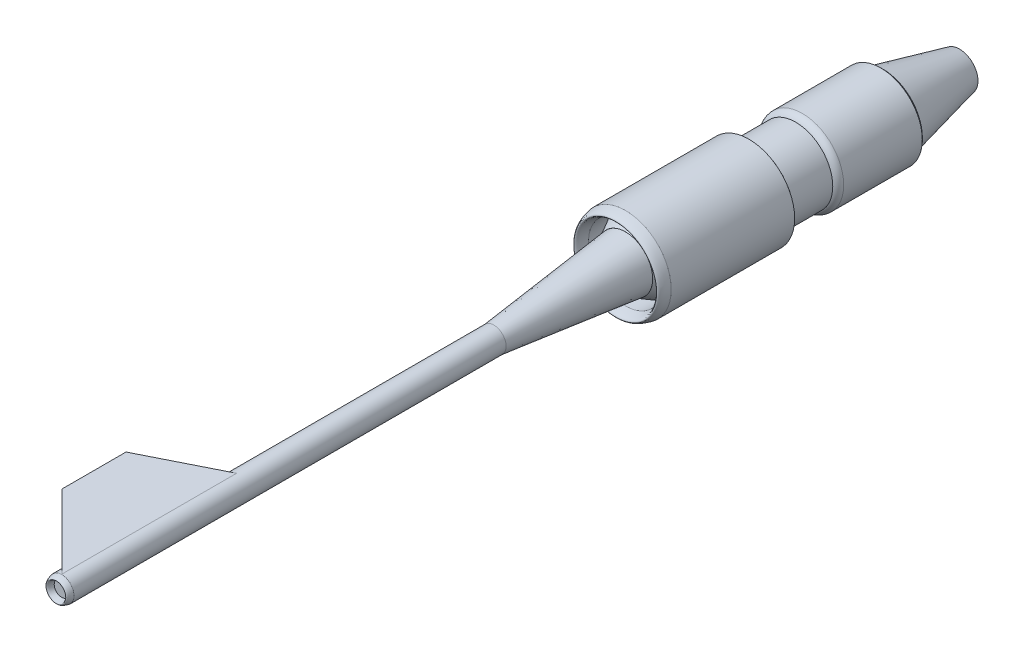
ISO-10303-21;
HEADER;
FILE_DESCRIPTION(('STEP AP214'),'2;1');
FILE_NAME('part.step','',(''),(''),'','','');
FILE_SCHEMA(('AUTOMOTIVE_DESIGN { 1 0 10303 214 1 1 1 1 }'));
ENDSEC;
DATA;
#1=APPLICATION_CONTEXT('core data for automotive mechanical design processes');
#2=APPLICATION_PROTOCOL_DEFINITION('international standard','automotive_design',2000,#1);
#3=PRODUCT_CONTEXT('',#1,'mechanical');
#4=PRODUCT('Part','Part','',(#3));
#5=PRODUCT_RELATED_PRODUCT_CATEGORY('part','',(#4));
#6=PRODUCT_DEFINITION_FORMATION('','',#4);
#7=PRODUCT_DEFINITION_CONTEXT('part definition',#1,'design');
#8=PRODUCT_DEFINITION('design','',#6,#7);
#9=PRODUCT_DEFINITION_SHAPE('','',#8);
#10=(LENGTH_UNIT() NAMED_UNIT(*) SI_UNIT(.MILLI.,.METRE.));
#11=(NAMED_UNIT(*) PLANE_ANGLE_UNIT() SI_UNIT($,.RADIAN.));
#12=(NAMED_UNIT(*) SI_UNIT($,.STERADIAN.) SOLID_ANGLE_UNIT());
#13=UNCERTAINTY_MEASURE_WITH_UNIT(LENGTH_MEASURE(1.E-05),#10,'distance_accuracy_value','');
#14=(GEOMETRIC_REPRESENTATION_CONTEXT(3) GLOBAL_UNCERTAINTY_ASSIGNED_CONTEXT((#13)) GLOBAL_UNIT_ASSIGNED_CONTEXT((#10,
#11,#12)) REPRESENTATION_CONTEXT('',''));
#15=CARTESIAN_POINT('',(0.,0.,0.));
#16=DIRECTION('',(0.,0.,1.));
#17=DIRECTION('',(1.,0.,0.));
#18=AXIS2_PLACEMENT_3D('',#15,#16,#17);
#19=CARTESIAN_POINT('',(1.46957615897682E-13,0.,5137.5));
#20=DIRECTION('',(0.,0.,-1.));
#21=DIRECTION('',(-1.,0.,0.));
#22=AXIS2_PLACEMENT_3D('',#19,#20,#21);
#23=CYLINDRICAL_SURFACE('',#22,112.5);
#24=CARTESIAN_POINT('',(1.46957615897682E-13,0.,3540.88446251693));
#25=DIRECTION('',(-0.447213595499958,0.,-0.894427190999916));
#26=DIRECTION('',(0.894427190999916,0.,-0.447213595499958));
#27=AXIS2_PLACEMENT_3D('',#24,#25,#26);
#28=ELLIPSE('',#27,125.778823734363,112.5);
#29=CARTESIAN_POINT('',(-93.5507258153162,62.4860920479709,3587.65982542459));
#30=VERTEX_POINT('',#29);
#31=CARTESIAN_POINT('',(-1.76892503385784,112.486092047971,3541.76892503386));
#32=VERTEX_POINT('',#31);
#33=EDGE_CURVE('E12',#30,#32,#28,.T.);
#34=ORIENTED_EDGE('',*,*,#33,.T.);
#35=DIRECTION('',(0.,0.,-1.));
#36=VECTOR('',#35,1.);
#37=CARTESIAN_POINT('',(-1.76892503385783,112.486092047971,5137.5));
#38=LINE('',#37,#36);
#39=CARTESIAN_POINT('',(-1.76892503385784,112.486092047971,5133.96214993228));
#40=VERTEX_POINT('',#39);
#41=EDGE_CURVE('E73',#32,#40,#38,.F.);
#42=ORIENTED_EDGE('',*,*,#41,.T.);
#43=CARTESIAN_POINT('',(1.46957615897682E-13,0.,5135.73107496614));
#44=DIRECTION('',(-0.707106781186547,0.,0.707106781186548));
#45=DIRECTION('',(-0.707106781186548,0.,-0.707106781186547));
#46=AXIS2_PLACEMENT_3D('',#43,#44,#45);
#47=ELLIPSE('',#46,159.099025766973,112.5);
#48=CARTESIAN_POINT('',(-93.5507258153162,62.4860920479709,5042.18034915083));
#49=VERTEX_POINT('',#48);
#50=EDGE_CURVE('E123',#40,#49,#47,.T.);
#51=ORIENTED_EDGE('',*,*,#50,.T.);
#52=DIRECTION('',(0.,0.,-1.));
#53=VECTOR('',#52,1.);
#54=CARTESIAN_POINT('',(-93.5507258153162,62.4860920479709,5137.5));
#55=LINE('',#54,#53);
#56=EDGE_CURVE('E120',#30,#49,#55,.F.);
#57=ORIENTED_EDGE('',*,*,#56,.F.);
#58=EDGE_LOOP('',(#34,#42,#51,#57));
#59=FACE_BOUND('',#58,.T.);
#60=CARTESIAN_POINT('',(1.46957615897682E-13,0.,1200.));
#61=DIRECTION('',(0.,0.,1.));
#62=DIRECTION('',(1.,0.,0.));
#63=AXIS2_PLACEMENT_3D('',#60,#61,#62);
#64=CIRCLE('',#63,112.5);
#65=CARTESIAN_POINT('',(112.5,0.,1200.));
#66=VERTEX_POINT('',#65);
#67=EDGE_CURVE('E169',#66,#66,#64,.T.);
#68=ORIENTED_EDGE('',*,*,#67,.T.);
#69=EDGE_LOOP('',(#68));
#70=FACE_BOUND('',#69,.T.);
#71=CARTESIAN_POINT('',(1.46957615897682E-13,0.,5137.5));
#72=DIRECTION('',(0.,0.,1.));
#73=DIRECTION('',(1.,0.,0.));
#74=AXIS2_PLACEMENT_3D('',#71,#72,#73);
#75=CIRCLE('',#74,112.5);
#76=CARTESIAN_POINT('',(112.5,0.,5137.5));
#77=VERTEX_POINT('',#76);
#78=EDGE_CURVE('E171',#77,#77,#75,.T.);
#79=ORIENTED_EDGE('',*,*,#78,.F.);
#80=EDGE_LOOP('',(#79));
#81=FACE_BOUND('',#80,.T.);
#82=ADVANCED_FACE('F52',(#59,#70,#81),#23,.T.);
#83=CARTESIAN_POINT('',(0.,0.,0.));
#84=DIRECTION('',(0.,0.,1.));
#85=DIRECTION('',(1.,0.,0.));
#86=AXIS2_PLACEMENT_3D('',#83,#84,#85);
#87=PLANE('',#86);
#88=CARTESIAN_POINT('',(0.,0.,0.));
#89=DIRECTION('',(0.,0.,-1.));
#90=DIRECTION('',(-1.,0.,0.));
#91=AXIS2_PLACEMENT_3D('',#88,#89,#90);
#92=CIRCLE('',#91,247.5);
#93=CARTESIAN_POINT('',(-247.5,0.,0.));
#94=VERTEX_POINT('',#93);
#95=EDGE_CURVE('E61',#94,#94,#92,.T.);
#96=ORIENTED_EDGE('',*,*,#95,.T.);
#97=EDGE_LOOP('',(#96));
#98=FACE_BOUND('',#97,.T.);
#99=ADVANCED_FACE('F54',(#98),#87,.F.);
#100=CARTESIAN_POINT('',(1.46957615897682E-13,0.,1200.));
#101=DIRECTION('',(0.,0.,-1.));
#102=DIRECTION('',(-1.,0.,0.));
#103=AXIS2_PLACEMENT_3D('',#100,#101,#102);
#104=CONICAL_SURFACE('',#103,112.5,0.112028962425988);
#105=ORIENTED_EDGE('',*,*,#95,.F.);
#106=EDGE_LOOP('',(#105));
#107=FACE_BOUND('',#106,.T.);
#108=ORIENTED_EDGE('',*,*,#67,.F.);
#109=EDGE_LOOP('',(#108));
#110=FACE_BOUND('',#109,.T.);
#111=ADVANCED_FACE('F148',(#107,#110),#104,.T.);
#112=CARTESIAN_POINT('',(0.,67.5,5137.5));
#113=CARTESIAN_POINT('',(0.,90.,5237.5));
#114=CARTESIAN_POINT('',(0.,112.5,5137.5));
#115=B_SPLINE_CURVE_WITH_KNOTS('',2,(#112,#113,#114),.UNSPECIFIED.,.F.,.F.,(3,3),(0.,1.),.UNSPECIFIED.);
#116=CARTESIAN_POINT('',(0.,0.,5137.5));
#117=DIRECTION('',(0.,0.,-1.));
#118=AXIS1_PLACEMENT('',#116,#117);
#119=SURFACE_OF_REVOLUTION('',#115,#118);
#120=ORIENTED_EDGE('',*,*,#78,.T.);
#121=EDGE_LOOP('',(#120));
#122=FACE_BOUND('',#121,.T.);
#123=CARTESIAN_POINT('',(0.,0.,5137.5));
#124=DIRECTION('',(0.,0.,-1.));
#125=DIRECTION('',(0.,1.,0.));
#126=AXIS2_PLACEMENT_3D('',#123,#124,#125);
#127=CIRCLE('',#126,67.5);
#128=CARTESIAN_POINT('',(0.,67.5,5137.5));
#129=VERTEX_POINT('',#128);
#130=EDGE_CURVE('E130',#129,#129,#127,.T.);
#131=ORIENTED_EDGE('',*,*,#130,.T.);
#132=EDGE_LOOP('',(#131));
#133=FACE_BOUND('',#132,.T.);
#134=ADVANCED_FACE('F143',(#122,#133),#119,.T.);
#135=CARTESIAN_POINT('',(1.46957615897682E-13,0.,5137.5));
#136=DIRECTION('',(0.,0.,1.));
#137=DIRECTION('',(1.,0.,0.));
#138=AXIS2_PLACEMENT_3D('',#135,#136,#137);
#139=PLANE('',#138);
#140=ORIENTED_EDGE('',*,*,#130,.F.);
#141=EDGE_LOOP('',(#140));
#142=FACE_BOUND('',#141,.T.);
#143=ADVANCED_FACE('F147',(#142),#139,.T.);
#144=CARTESIAN_POINT('',(0.,112.486092047971,0.));
#145=DIRECTION('',(0.,1.,0.));
#146=DIRECTION('',(0.,0.,1.));
#147=AXIS2_PLACEMENT_3D('',#144,#145,#146);
#148=PLANE('',#147);
#149=ORIENTED_EDGE('',*,*,#41,.F.);
#150=DIRECTION('',(-0.894427190999916,0.,0.447213595499958));
#151=VECTOR('',#150,1.);
#152=CARTESIAN_POINT('',(-673.231074966143,112.486092047971,3877.5));
#153=LINE('',#152,#151);
#154=CARTESIAN_POINT('',(-673.231074966143,112.486092047971,3877.5));
#155=VERTEX_POINT('',#154);
#156=EDGE_CURVE('E118',#32,#155,#153,.T.);
#157=ORIENTED_EDGE('',*,*,#156,.T.);
#158=DIRECTION('',(0.,0.,1.));
#159=VECTOR('',#158,1.);
#160=CARTESIAN_POINT('',(-673.231074966143,112.486092047971,4462.5));
#161=LINE('',#160,#159);
#162=CARTESIAN_POINT('',(-673.231074966143,112.486092047971,4462.5));
#163=VERTEX_POINT('',#162);
#164=EDGE_CURVE('E108',#155,#163,#161,.T.);
#165=ORIENTED_EDGE('',*,*,#164,.T.);
#166=DIRECTION('',(0.707106781186548,0.,0.707106781186547));
#167=VECTOR('',#166,1.);
#168=CARTESIAN_POINT('',(-673.231074966143,112.486092047971,4462.5));
#169=LINE('',#168,#167);
#170=EDGE_CURVE('E68',#163,#40,#169,.T.);
#171=ORIENTED_EDGE('',*,*,#170,.T.);
#172=EDGE_LOOP('',(#149,#157,#165,#171));
#173=FACE_BOUND('',#172,.T.);
#174=ADVANCED_FACE('F154',(#173),#148,.T.);
#175=CARTESIAN_POINT('',(-673.231074966143,62.4860920479709,4462.5));
#176=DIRECTION('',(-0.707106781186547,0.,0.707106781186548));
#177=DIRECTION('',(0.707106781186548,0.,0.707106781186547));
#178=AXIS2_PLACEMENT_3D('',#175,#176,#177);
#179=PLANE('',#178);
#180=ORIENTED_EDGE('',*,*,#50,.F.);
#181=ORIENTED_EDGE('',*,*,#170,.F.);
#182=DIRECTION('',(0.,1.,0.));
#183=VECTOR('',#182,1.);
#184=CARTESIAN_POINT('',(-673.231074966143,62.4860920479709,4462.5));
#185=LINE('',#184,#183);
#186=CARTESIAN_POINT('',(-673.231074966143,62.4860920479709,4462.5));
#187=VERTEX_POINT('',#186);
#188=EDGE_CURVE('E109',#187,#163,#185,.T.);
#189=ORIENTED_EDGE('',*,*,#188,.F.);
#190=DIRECTION('',(0.707106781186548,0.,0.707106781186547));
#191=VECTOR('',#190,1.);
#192=CARTESIAN_POINT('',(-673.231074966143,62.4860920479709,4462.5));
#193=LINE('',#192,#191);
#194=EDGE_CURVE('E103',#187,#49,#193,.T.);
#195=ORIENTED_EDGE('',*,*,#194,.T.);
#196=EDGE_LOOP('',(#180,#181,#189,#195));
#197=FACE_BOUND('',#196,.T.);
#198=ADVANCED_FACE('F150',(#197),#179,.T.);
#199=CARTESIAN_POINT('',(0.,62.4860920479709,0.));
#200=DIRECTION('',(0.,1.,0.));
#201=DIRECTION('',(0.,0.,1.));
#202=AXIS2_PLACEMENT_3D('',#199,#200,#201);
#203=PLANE('',#202);
#204=DIRECTION('',(-0.894427190999916,0.,0.447213595499958));
#205=VECTOR('',#204,1.);
#206=CARTESIAN_POINT('',(-673.231074966143,62.4860920479709,3877.5));
#207=LINE('',#206,#205);
#208=CARTESIAN_POINT('',(-673.231074966143,62.4860920479709,3877.5));
#209=VERTEX_POINT('',#208);
#210=EDGE_CURVE('E94',#30,#209,#207,.T.);
#211=ORIENTED_EDGE('',*,*,#210,.F.);
#212=ORIENTED_EDGE('',*,*,#56,.T.);
#213=ORIENTED_EDGE('',*,*,#194,.F.);
#214=DIRECTION('',(0.,0.,1.));
#215=VECTOR('',#214,1.);
#216=CARTESIAN_POINT('',(-673.231074966143,62.4860920479709,4462.5));
#217=LINE('',#216,#215);
#218=EDGE_CURVE('E102',#209,#187,#217,.T.);
#219=ORIENTED_EDGE('',*,*,#218,.F.);
#220=EDGE_LOOP('',(#211,#212,#213,#219));
#221=FACE_BOUND('',#220,.T.);
#222=ADVANCED_FACE('F112',(#221),#203,.F.);
#223=CARTESIAN_POINT('',(-673.231074966143,62.4860920479709,4462.5));
#224=DIRECTION('',(-1.,0.,0.));
#225=DIRECTION('',(0.,0.,1.));
#226=AXIS2_PLACEMENT_3D('',#223,#224,#225);
#227=PLANE('',#226);
#228=ORIENTED_EDGE('',*,*,#164,.F.);
#229=DIRECTION('',(0.,1.,0.));
#230=VECTOR('',#229,1.);
#231=CARTESIAN_POINT('',(-673.231074966143,62.4860920479709,3877.5));
#232=LINE('',#231,#230);
#233=EDGE_CURVE('E97',#209,#155,#232,.T.);
#234=ORIENTED_EDGE('',*,*,#233,.F.);
#235=ORIENTED_EDGE('',*,*,#218,.T.);
#236=ORIENTED_EDGE('',*,*,#188,.T.);
#237=EDGE_LOOP('',(#228,#234,#235,#236));
#238=FACE_BOUND('',#237,.T.);
#239=ADVANCED_FACE('F107',(#238),#227,.T.);
#240=CARTESIAN_POINT('',(-673.231074966143,62.4860920479709,3877.5));
#241=DIRECTION('',(-0.447213595499958,0.,-0.894427190999916));
#242=DIRECTION('',(-0.894427190999916,0.,0.447213595499958));
#243=AXIS2_PLACEMENT_3D('',#240,#241,#242);
#244=PLANE('',#243);
#245=ORIENTED_EDGE('',*,*,#33,.F.);
#246=ORIENTED_EDGE('',*,*,#210,.T.);
#247=ORIENTED_EDGE('',*,*,#233,.T.);
#248=ORIENTED_EDGE('',*,*,#156,.F.);
#249=EDGE_LOOP('',(#245,#246,#247,#248));
#250=FACE_BOUND('',#249,.T.);
#251=ADVANCED_FACE('F96',(#250),#244,.T.);
#252=CLOSED_SHELL('',(#82,#99,#111,#134,#143,#174,#198,#222,#239,#251));
#253=MANIFOLD_SOLID_BREP('B2',#252);
#254=CARTESIAN_POINT('',(0.,0.,-1125.));
#255=DIRECTION('',(0.,0.,1.));
#256=DIRECTION('',(1.,0.,0.));
#257=AXIS2_PLACEMENT_3D('',#254,#255,#256);
#258=CYLINDRICAL_SURFACE('',#257,337.5);
#259=CARTESIAN_POINT('',(0.,0.,-306.632414300902));
#260=DIRECTION('',(0.,0.,1.));
#261=DIRECTION('',(1.,0.,0.));
#262=AXIS2_PLACEMENT_3D('',#259,#260,#261);
#263=CIRCLE('',#262,337.5);
#264=CARTESIAN_POINT('',(337.5,0.,-306.632414300902));
#265=VERTEX_POINT('',#264);
#266=EDGE_CURVE('E265',#265,#265,#263,.F.);
#267=ORIENTED_EDGE('',*,*,#266,.F.);
#268=EDGE_LOOP('',(#267));
#269=FACE_BOUND('',#268,.T.);
#270=CARTESIAN_POINT('',(0.,0.,-1125.));
#271=DIRECTION('',(0.,0.,-1.));
#272=DIRECTION('',(-1.,0.,0.));
#273=AXIS2_PLACEMENT_3D('',#270,#271,#272);
#274=CIRCLE('',#273,337.5);
#275=CARTESIAN_POINT('',(-337.5,0.,-1125.));
#276=VERTEX_POINT('',#275);
#277=EDGE_CURVE('E261',#276,#276,#274,.F.);
#278=ORIENTED_EDGE('',*,*,#277,.F.);
#279=EDGE_LOOP('',(#278));
#280=FACE_BOUND('',#279,.T.);
#281=ADVANCED_FACE('F254',(#269,#280),#258,.F.);
#282=CARTESIAN_POINT('',(0.,0.,0.));
#283=DIRECTION('',(0.,0.,1.));
#284=DIRECTION('',(1.,0.,0.));
#285=AXIS2_PLACEMENT_3D('',#282,#283,#284);
#286=CIRCLE('',#285,337.5);
#287=CARTESIAN_POINT('',(337.5,0.,0.));
#288=VERTEX_POINT('',#287);
#289=EDGE_CURVE('E277',#288,#288,#286,.T.);
#290=ORIENTED_EDGE('',*,*,#289,.T.);
#291=EDGE_LOOP('',(#290));
#292=FACE_BOUND('',#291,.T.);
#293=CARTESIAN_POINT('',(0.,0.,-163.537287627148));
#294=DIRECTION('',(0.,0.,-1.));
#295=DIRECTION('',(-1.,0.,0.));
#296=AXIS2_PLACEMENT_3D('',#293,#294,#295);
#297=CIRCLE('',#296,337.5);
#298=CARTESIAN_POINT('',(-337.5,0.,-163.537287627148));
#299=VERTEX_POINT('',#298);
#300=EDGE_CURVE('E269',#299,#299,#297,.F.);
#301=ORIENTED_EDGE('',*,*,#300,.F.);
#302=EDGE_LOOP('',(#301));
#303=FACE_BOUND('',#302,.T.);
#304=ADVANCED_FACE('F298',(#292,#303),#258,.F.);
#305=CARTESIAN_POINT('',(0.,0.,-1125.));
#306=DIRECTION('',(0.,0.,1.));
#307=DIRECTION('',(1.,0.,0.));
#308=AXIS2_PLACEMENT_3D('',#305,#306,#307);
#309=CYLINDRICAL_SURFACE('',#308,416.25);
#310=CARTESIAN_POINT('',(0.,0.,-1125.));
#311=DIRECTION('',(0.,0.,1.));
#312=DIRECTION('',(1.,0.,0.));
#313=AXIS2_PLACEMENT_3D('',#310,#311,#312);
#314=CIRCLE('',#313,416.25);
#315=CARTESIAN_POINT('',(416.25,0.,-1125.));
#316=VERTEX_POINT('',#315);
#317=EDGE_CURVE('E332',#316,#316,#314,.T.);
#318=ORIENTED_EDGE('',*,*,#317,.T.);
#319=EDGE_LOOP('',(#318));
#320=FACE_BOUND('',#319,.T.);
#321=CARTESIAN_POINT('',(0.,0.,0.));
#322=DIRECTION('',(0.,0.,1.));
#323=DIRECTION('',(1.,0.,0.));
#324=AXIS2_PLACEMENT_3D('',#321,#322,#323);
#325=CIRCLE('',#324,416.25);
#326=CARTESIAN_POINT('',(416.25,0.,0.));
#327=VERTEX_POINT('',#326);
#328=EDGE_CURVE('E274',#327,#327,#325,.T.);
#329=ORIENTED_EDGE('',*,*,#328,.F.);
#330=EDGE_LOOP('',(#329));
#331=FACE_BOUND('',#330,.T.);
#332=ADVANCED_FACE('F256',(#320,#331),#309,.T.);
#333=CARTESIAN_POINT('',(0.,416.25,0.));
#334=CARTESIAN_POINT('',(0.,376.875,180.));
#335=CARTESIAN_POINT('',(0.,337.5,0.));
#336=B_SPLINE_CURVE_WITH_KNOTS('',2,(#333,#334,#335),.UNSPECIFIED.,.F.,.F.,(3,3),(0.,1.),.UNSPECIFIED.);
#337=CARTESIAN_POINT('',(0.,0.,0.));
#338=DIRECTION('',(0.,0.,1.));
#339=AXIS1_PLACEMENT('',#337,#338);
#340=SURFACE_OF_REVOLUTION('',#336,#339);
#341=ORIENTED_EDGE('',*,*,#289,.F.);
#342=EDGE_LOOP('',(#341));
#343=FACE_BOUND('',#342,.T.);
#344=ORIENTED_EDGE('',*,*,#328,.T.);
#345=EDGE_LOOP('',(#344));
#346=FACE_BOUND('',#345,.T.);
#347=ADVANCED_FACE('F290',(#343,#346),#340,.T.);
#348=CARTESIAN_POINT('',(0.,247.5,-306.632414300902));
#349=DIRECTION('',(0.,0.,1.));
#350=DIRECTION('',(1.,0.,0.));
#351=AXIS2_PLACEMENT_3D('',#348,#349,#350);
#352=PLANE('',#351);
#353=CARTESIAN_POINT('',(0.,0.,-306.632414300902));
#354=DIRECTION('',(0.,0.,1.));
#355=DIRECTION('',(1.,0.,0.));
#356=AXIS2_PLACEMENT_3D('',#353,#354,#355);
#357=CIRCLE('',#356,247.5);
#358=CARTESIAN_POINT('',(247.5,0.,-306.632414300902));
#359=VERTEX_POINT('',#358);
#360=EDGE_CURVE('E280',#359,#359,#357,.T.);
#361=ORIENTED_EDGE('',*,*,#360,.T.);
#362=EDGE_LOOP('',(#361));
#363=FACE_BOUND('',#362,.T.);
#364=ORIENTED_EDGE('',*,*,#266,.T.);
#365=EDGE_LOOP('',(#364));
#366=FACE_BOUND('',#365,.T.);
#367=ADVANCED_FACE('F293',(#363,#366),#352,.F.);
#368=CARTESIAN_POINT('',(0.,0.,-306.632414300902));
#369=DIRECTION('',(0.,0.,-1.));
#370=DIRECTION('',(-1.,0.,0.));
#371=AXIS2_PLACEMENT_3D('',#368,#369,#370);
#372=CONICAL_SURFACE('',#371,416.25,0.503098996215438);
#373=CARTESIAN_POINT('',(0.,0.,0.));
#374=DIRECTION('',(0.,0.,1.));
#375=DIRECTION('',(1.,0.,0.));
#376=AXIS2_PLACEMENT_3D('',#373,#374,#375);
#377=CIRCLE('',#376,247.5);
#378=CARTESIAN_POINT('',(247.5,0.,0.));
#379=VERTEX_POINT('',#378);
#380=EDGE_CURVE('E337',#379,#379,#377,.T.);
#381=ORIENTED_EDGE('',*,*,#380,.F.);
#382=EDGE_LOOP('',(#381));
#383=FACE_BOUND('',#382,.T.);
#384=ORIENTED_EDGE('',*,*,#300,.T.);
#385=EDGE_LOOP('',(#384));
#386=FACE_BOUND('',#385,.T.);
#387=ADVANCED_FACE('F308',(#383,#386),#372,.T.);
#388=CARTESIAN_POINT('',(0.,0.,0.));
#389=DIRECTION('',(0.,0.,1.));
#390=DIRECTION('',(1.,0.,0.));
#391=AXIS2_PLACEMENT_3D('',#388,#389,#390);
#392=CYLINDRICAL_SURFACE('',#391,247.5);
#393=ORIENTED_EDGE('',*,*,#360,.F.);
#394=EDGE_LOOP('',(#393));
#395=FACE_BOUND('',#394,.T.);
#396=ORIENTED_EDGE('',*,*,#380,.T.);
#397=EDGE_LOOP('',(#396));
#398=FACE_BOUND('',#397,.T.);
#399=ADVANCED_FACE('F295',(#395,#398),#392,.F.);
#400=CARTESIAN_POINT('',(0.,337.5,-1155.));
#401=CARTESIAN_POINT('',(0.,382.589285714286,-1155.));
#402=CARTESIAN_POINT('',(0.,416.25,-1125.));
#403=(BOUNDED_CURVE() B_SPLINE_CURVE(2,(#400,#401,#402),.UNSPECIFIED.,.F.,
.F.) B_SPLINE_CURVE_WITH_KNOTS((3,3),(0.,1.),
.UNSPECIFIED.) CURVE() GEOMETRIC_REPRESENTATION_ITEM() RATIONAL_B_SPLINE_CURVE((1.,
0.806097205553273,1.)) REPRESENTATION_ITEM(''));
#404=CARTESIAN_POINT('',(0.,0.,-1125.));
#405=DIRECTION('',(0.,0.,1.));
#406=AXIS1_PLACEMENT('',#404,#405);
#407=SURFACE_OF_REVOLUTION('',#403,#406);
#408=ORIENTED_EDGE('',*,*,#317,.F.);
#409=EDGE_LOOP('',(#408));
#410=FACE_BOUND('',#409,.T.);
#411=CARTESIAN_POINT('',(0.,0.,-1155.));
#412=DIRECTION('',(0.,0.,1.));
#413=DIRECTION('',(1.,0.,0.));
#414=AXIS2_PLACEMENT_3D('',#411,#412,#413);
#415=CIRCLE('',#414,337.5);
#416=CARTESIAN_POINT('',(337.5,0.,-1155.));
#417=VERTEX_POINT('',#416);
#418=EDGE_CURVE('E330',#417,#417,#415,.F.);
#419=ORIENTED_EDGE('',*,*,#418,.F.);
#420=EDGE_LOOP('',(#419));
#421=FACE_BOUND('',#420,.T.);
#422=ADVANCED_FACE('F317',(#410,#421),#407,.T.);
#423=CARTESIAN_POINT('',(0.,0.,-1614.96422928336));
#424=DIRECTION('',(0.,0.,-1.));
#425=DIRECTION('',(-1.,0.,0.));
#426=AXIS2_PLACEMENT_3D('',#423,#424,#425);
#427=TOROIDAL_SURFACE('',#426,305.432483949171,71.5524158465949);
#428=CARTESIAN_POINT('',(0.,0.,-1611.));
#429=DIRECTION('',(0.,0.,-1.));
#430=DIRECTION('',(-1.,0.,0.));
#431=AXIS2_PLACEMENT_3D('',#428,#429,#430);
#432=CIRCLE('',#431,376.875);
#433=CARTESIAN_POINT('',(376.875,0.,-1611.));
#434=VERTEX_POINT('',#433);
#435=EDGE_CURVE('E478',#434,#434,#432,.T.);
#436=ORIENTED_EDGE('',*,*,#435,.F.);
#437=EDGE_LOOP('',(#436));
#438=FACE_BOUND('',#437,.T.);
#439=CARTESIAN_POINT('',(0.,0.,-1551.));
#440=DIRECTION('',(0.,0.,-1.));
#441=DIRECTION('',(-1.,0.,0.));
#442=AXIS2_PLACEMENT_3D('',#439,#440,#441);
#443=CIRCLE('',#442,337.5);
#444=CARTESIAN_POINT('',(-337.5,0.,-1551.));
#445=VERTEX_POINT('',#444);
#446=EDGE_CURVE('E467',#445,#445,#443,.T.);
#447=ORIENTED_EDGE('',*,*,#446,.T.);
#448=EDGE_LOOP('',(#447));
#449=FACE_BOUND('',#448,.T.);
#450=ADVANCED_FACE('F321',(#438,#449),#427,.T.);
#451=CARTESIAN_POINT('',(0.,0.,-2327.));
#452=DIRECTION('',(0.,0.,1.));
#453=DIRECTION('',(1.,0.,0.));
#454=AXIS2_PLACEMENT_3D('',#451,#452,#453);
#455=CYLINDRICAL_SURFACE('',#454,376.875);
#456=CARTESIAN_POINT('',(0.,0.,-2327.));
#457=DIRECTION('',(0.,0.,-1.));
#458=DIRECTION('',(-1.,0.,0.));
#459=AXIS2_PLACEMENT_3D('',#456,#457,#458);
#460=CIRCLE('',#459,376.875);
#461=CARTESIAN_POINT('',(376.875,0.,-2327.));
#462=VERTEX_POINT('',#461);
#463=EDGE_CURVE('E469',#462,#462,#460,.T.);
#464=CARTESIAN_POINT('',(376.875,0.,-2327.));
#465=CARTESIAN_POINT('',(376.875,0.,-2319.54166666667));
#466=CARTESIAN_POINT('',(376.875,0.,-2312.08333333333));
#467=CARTESIAN_POINT('',(376.875,0.,-2297.16666666667));
#468=CARTESIAN_POINT('',(376.875,0.,-2289.70833333333));
#469=CARTESIAN_POINT('',(376.875,0.,-2274.79166666667));
#470=CARTESIAN_POINT('',(376.875,0.,-2267.33333333333));
#471=CARTESIAN_POINT('',(376.875,0.,-2252.41666666667));
#472=CARTESIAN_POINT('',(376.875,0.,-2244.95833333333));
#473=CARTESIAN_POINT('',(376.875,0.,-2230.04166666667));
#474=CARTESIAN_POINT('',(376.875,0.,-2222.58333333333));
#475=CARTESIAN_POINT('',(376.875,0.,-2207.66666666667));
#476=CARTESIAN_POINT('',(376.875,0.,-2200.20833333333));
#477=CARTESIAN_POINT('',(376.875,0.,-2185.29166666667));
#478=CARTESIAN_POINT('',(376.875,0.,-2177.83333333333));
#479=CARTESIAN_POINT('',(376.875,0.,-2162.91666666667));
#480=CARTESIAN_POINT('',(376.875,0.,-2155.45833333333));
#481=CARTESIAN_POINT('',(376.875,0.,-2140.54166666667));
#482=CARTESIAN_POINT('',(376.875,0.,-2133.08333333333));
#483=CARTESIAN_POINT('',(376.875,0.,-2118.16666666667));
#484=CARTESIAN_POINT('',(376.875,0.,-2110.70833333333));
#485=CARTESIAN_POINT('',(376.875,0.,-2095.79166666667));
#486=CARTESIAN_POINT('',(376.875,0.,-2088.33333333333));
#487=CARTESIAN_POINT('',(376.875,0.,-2073.41666666667));
#488=CARTESIAN_POINT('',(376.875,0.,-2065.95833333333));
#489=CARTESIAN_POINT('',(376.875,0.,-2051.04166666667));
#490=CARTESIAN_POINT('',(376.875,0.,-2043.58333333333));
#491=CARTESIAN_POINT('',(376.875,0.,-2028.66666666667));
#492=CARTESIAN_POINT('',(376.875,0.,-2021.20833333333));
#493=CARTESIAN_POINT('',(376.875,0.,-2006.29166666667));
#494=CARTESIAN_POINT('',(376.875,0.,-1998.83333333333));
#495=CARTESIAN_POINT('',(376.875,0.,-1983.91666666667));
#496=CARTESIAN_POINT('',(376.875,0.,-1976.45833333333));
#497=CARTESIAN_POINT('',(376.875,0.,-1961.54166666667));
#498=CARTESIAN_POINT('',(376.875,0.,-1954.08333333333));
#499=CARTESIAN_POINT('',(376.875,0.,-1939.16666666667));
#500=CARTESIAN_POINT('',(376.875,0.,-1931.70833333333));
#501=CARTESIAN_POINT('',(376.875,0.,-1916.79166666667));
#502=CARTESIAN_POINT('',(376.875,0.,-1909.33333333333));
#503=CARTESIAN_POINT('',(376.875,0.,-1894.41666666667));
#504=CARTESIAN_POINT('',(376.875,0.,-1886.95833333333));
#505=CARTESIAN_POINT('',(376.875,0.,-1872.04166666667));
#506=CARTESIAN_POINT('',(376.875,0.,-1864.58333333333));
#507=CARTESIAN_POINT('',(376.875,0.,-1849.66666666667));
#508=CARTESIAN_POINT('',(376.875,0.,-1842.20833333333));
#509=CARTESIAN_POINT('',(376.875,0.,-1827.29166666667));
#510=CARTESIAN_POINT('',(376.875,0.,-1819.83333333333));
#511=CARTESIAN_POINT('',(376.875,0.,-1804.91666666667));
#512=CARTESIAN_POINT('',(376.875,0.,-1797.45833333333));
#513=CARTESIAN_POINT('',(376.875,0.,-1782.54166666667));
#514=CARTESIAN_POINT('',(376.875,0.,-1775.08333333333));
#515=CARTESIAN_POINT('',(376.875,0.,-1760.16666666667));
#516=CARTESIAN_POINT('',(376.875,0.,-1752.70833333333));
#517=CARTESIAN_POINT('',(376.875,0.,-1737.79166666667));
#518=CARTESIAN_POINT('',(376.875,0.,-1730.33333333333));
#519=CARTESIAN_POINT('',(376.875,0.,-1715.41666666667));
#520=CARTESIAN_POINT('',(376.875,0.,-1707.95833333333));
#521=CARTESIAN_POINT('',(376.875,0.,-1693.04166666667));
#522=CARTESIAN_POINT('',(376.875,0.,-1685.58333333333));
#523=CARTESIAN_POINT('',(376.875,0.,-1670.66666666667));
#524=CARTESIAN_POINT('',(376.875,0.,-1663.20833333333));
#525=CARTESIAN_POINT('',(376.875,0.,-1648.29166666667));
#526=CARTESIAN_POINT('',(376.875,0.,-1640.83333333333));
#527=CARTESIAN_POINT('',(376.875,0.,-1625.91666666667));
#528=CARTESIAN_POINT('',(376.875,0.,-1618.45833333333));
#529=CARTESIAN_POINT('',(376.875,0.,-1611.));
#530=B_SPLINE_CURVE_WITH_KNOTS('',3,(#464,#465,#466,#467,#468,#469,#470,#471,#472,#473,#474,
#475,#476,#477,#478,#479,#480,#481,#482,#483,#484,#485,#486,#487,#488,#489,#490,#491,#492,#493,
#494,#495,#496,#497,#498,#499,#500,#501,#502,#503,#504,#505,#506,#507,#508,#509,#510,#511,#512,
#513,#514,#515,#516,#517,#518,#519,#520,#521,#522,#523,#524,#525,#526,#527,#528,#529),
.UNSPECIFIED.,.F.,.F.,(4,2,2,2,2,2,2,2,2,2,2,2,2,2,2,2,2,2,2,2,2,2,2,2,2,2,2,2,2,2,2,2,4),(0.,
22.3750000000003,44.7500000000001,67.1250000000003,89.5000000000001,111.875,134.25,156.625,179.,
201.375,223.75,246.125,268.5,290.875,313.25,335.625,358.,380.375,402.75,425.125,447.5,469.875,
492.25,514.625,537.,559.375,581.75,604.125,626.5,648.875,671.25,693.625,716.),.UNSPECIFIED.);
#531=EDGE_CURVE('BSEAM359',#462,#434,#530,.T.);
#532=ORIENTED_EDGE('',*,*,#463,.F.);
#533=ORIENTED_EDGE('',*,*,#435,.T.);
#534=ORIENTED_EDGE('',*,*,#531,.T.);
#535=ORIENTED_EDGE('',*,*,#531,.F.);
#536=EDGE_LOOP('',(#532,#534,#533,#535));
#537=FACE_BOUND('',#536,.T.);
#538=ADVANCED_FACE('F359',(#537),#455,.T.);
#539=CARTESIAN_POINT('',(0.,0.,-1611.));
#540=DIRECTION('',(0.,0.,1.));
#541=DIRECTION('',(1.,0.,0.));
#542=AXIS2_PLACEMENT_3D('',#539,#540,#541);
#543=CYLINDRICAL_SURFACE('',#542,337.5);
#544=ORIENTED_EDGE('',*,*,#446,.F.);
#545=EDGE_LOOP('',(#544));
#546=FACE_BOUND('',#545,.T.);
#547=ORIENTED_EDGE('',*,*,#418,.T.);
#548=EDGE_LOOP('',(#547));
#549=FACE_BOUND('',#548,.T.);
#550=ADVANCED_FACE('F323',(#546,#549),#543,.T.);
#551=CARTESIAN_POINT('',(0.,0.,-1125.));
#552=DIRECTION('',(0.,0.,-1.));
#553=DIRECTION('',(-1.,0.,0.));
#554=AXIS2_PLACEMENT_3D('',#551,#552,#553);
#555=PLANE('',#554);
#556=ORIENTED_EDGE('',*,*,#277,.T.);
#557=EDGE_LOOP('',(#556));
#558=FACE_BOUND('',#557,.T.);
#559=ADVANCED_FACE('F375',(#558),#555,.F.);
#560=CARTESIAN_POINT('',(0.,330.618023233874,-2356.19997253065));
#561=CARTESIAN_POINT('',(0.,357.1875,-2356.19997253065));
#562=CARTESIAN_POINT('',(0.,376.875,-2327.));
#563=(BOUNDED_CURVE() B_SPLINE_CURVE(2,(#560,#561,#562),.UNSPECIFIED.,.F.,
.F.) B_SPLINE_CURVE_WITH_KNOTS((3,3),(0.,1.),
.UNSPECIFIED.) CURVE() GEOMETRIC_REPRESENTATION_ITEM() RATIONAL_B_SPLINE_CURVE((1.,
0.829833158093808,1.)) REPRESENTATION_ITEM(''));
#564=CARTESIAN_POINT('',(0.,0.,-2327.));
#565=DIRECTION('',(0.,0.,1.));
#566=AXIS1_PLACEMENT('',#564,#565);
#567=SURFACE_OF_REVOLUTION('',#563,#566);
#568=ORIENTED_EDGE('',*,*,#463,.T.);
#569=EDGE_LOOP('',(#568));
#570=FACE_BOUND('',#569,.T.);
#571=CARTESIAN_POINT('',(0.,0.,-2356.19997253065));
#572=DIRECTION('',(0.,0.,1.));
#573=DIRECTION('',(1.,0.,0.));
#574=AXIS2_PLACEMENT_3D('',#571,#572,#573);
#575=CIRCLE('',#574,330.618023233874);
#576=CARTESIAN_POINT('',(330.618023233874,0.,-2356.19997253065));
#577=VERTEX_POINT('',#576);
#578=EDGE_CURVE('E51',#577,#577,#575,.T.);
#579=ORIENTED_EDGE('',*,*,#578,.T.);
#580=EDGE_LOOP('',(#579));
#581=FACE_BOUND('',#580,.T.);
#582=ADVANCED_FACE('F382',(#570,#581),#567,.T.);
#583=CARTESIAN_POINT('',(0.,0.,-3043.));
#584=DIRECTION('',(0.,0.,1.));
#585=DIRECTION('',(1.,0.,0.));
#586=AXIS2_PLACEMENT_3D('',#583,#584,#585);
#587=PLANE('',#586);
#588=CARTESIAN_POINT('',(0.,0.,-3043.));
#589=DIRECTION('',(0.,0.,1.));
#590=DIRECTION('',(1.,0.,0.));
#591=AXIS2_PLACEMENT_3D('',#588,#589,#590);
#592=CIRCLE('',#591,168.75);
#593=CARTESIAN_POINT('',(168.75,0.,-3043.));
#594=VERTEX_POINT('',#593);
#595=EDGE_CURVE('E473',#594,#594,#592,.T.);
#596=ORIENTED_EDGE('',*,*,#595,.F.);
#597=EDGE_LOOP('',(#596));
#598=FACE_BOUND('',#597,.T.);
#599=ADVANCED_FACE('F388',(#598),#587,.F.);
#600=CARTESIAN_POINT('',(0.,0.,-3043.));
#601=DIRECTION('',(0.,0.,1.));
#602=DIRECTION('',(1.,0.,0.));
#603=AXIS2_PLACEMENT_3D('',#600,#601,#602);
#604=CONICAL_SURFACE('',#603,168.75,0.231460403304214);
#605=ORIENTED_EDGE('',*,*,#595,.T.);
#606=EDGE_LOOP('',(#605));
#607=FACE_BOUND('',#606,.T.);
#608=ORIENTED_EDGE('',*,*,#578,.F.);
#609=EDGE_LOOP('',(#608));
#610=FACE_BOUND('',#609,.T.);
#611=ADVANCED_FACE('F396',(#607,#610),#604,.T.);
#612=CLOSED_SHELL('',(#281,#304,#332,#347,#367,#387,#399,#422,#450,#538,#550,#559,#582,#599,#611));
#613=MANIFOLD_SOLID_BREP('B6',#612);
#614=ADVANCED_BREP_SHAPE_REPRESENTATION('',(#18,#253,#613),#14);
#615=SHAPE_DEFINITION_REPRESENTATION(#9,#614);
ENDSEC;
END-ISO-10303-21;
